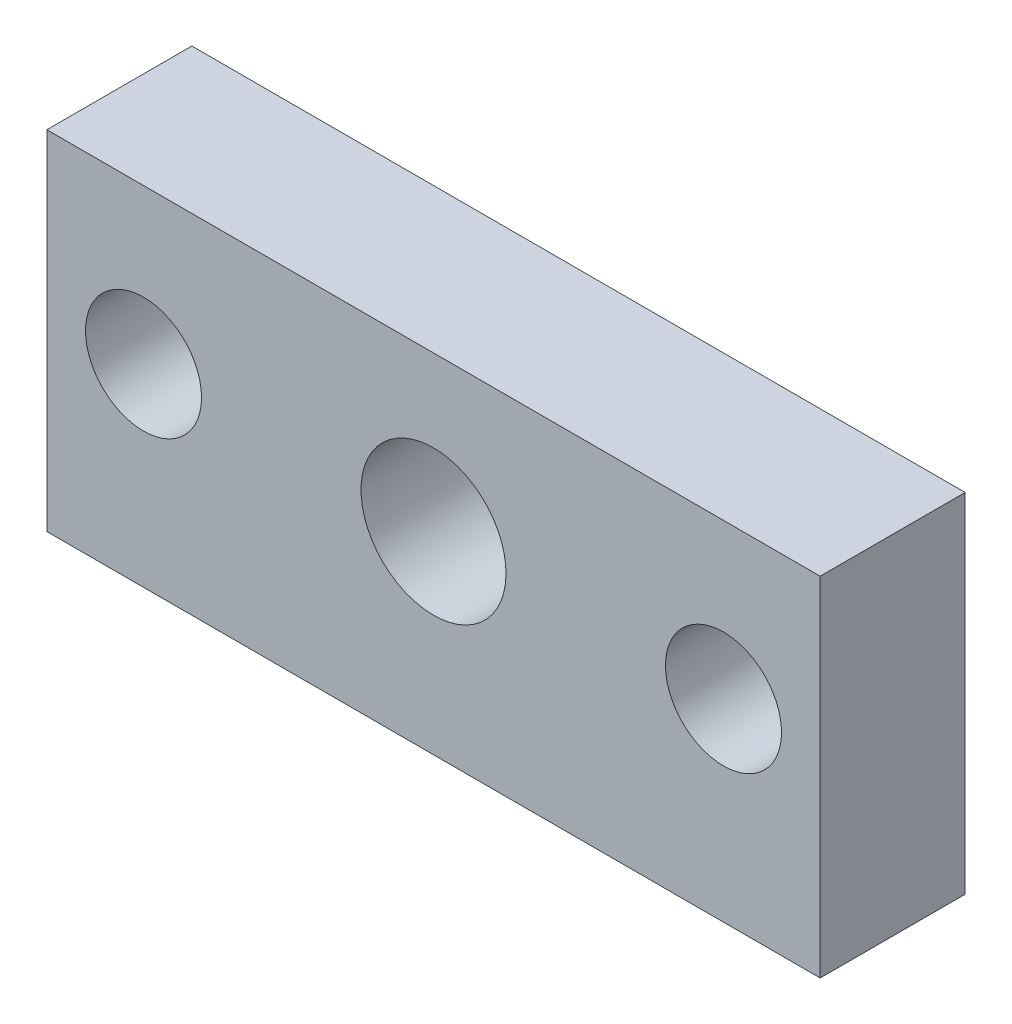
ISO-10303-21;
HEADER;
FILE_DESCRIPTION(('STEP AP214'),'2;1');
FILE_NAME('part.step','',(''),(''),'','','');
FILE_SCHEMA(('AUTOMOTIVE_DESIGN { 1 0 10303 214 1 1 1 1 }'));
ENDSEC;
DATA;
#1=APPLICATION_CONTEXT('core data for automotive mechanical design processes');
#2=APPLICATION_PROTOCOL_DEFINITION('international standard','automotive_design',2000,#1);
#3=PRODUCT_CONTEXT('',#1,'mechanical');
#4=PRODUCT('Part','Part','',(#3));
#5=PRODUCT_RELATED_PRODUCT_CATEGORY('part','',(#4));
#6=PRODUCT_DEFINITION_FORMATION('','',#4);
#7=PRODUCT_DEFINITION_CONTEXT('part definition',#1,'design');
#8=PRODUCT_DEFINITION('design','',#6,#7);
#9=PRODUCT_DEFINITION_SHAPE('','',#8);
#10=(LENGTH_UNIT() NAMED_UNIT(*) SI_UNIT(.MILLI.,.METRE.));
#11=(NAMED_UNIT(*) PLANE_ANGLE_UNIT() SI_UNIT($,.RADIAN.));
#12=(NAMED_UNIT(*) SI_UNIT($,.STERADIAN.) SOLID_ANGLE_UNIT());
#13=UNCERTAINTY_MEASURE_WITH_UNIT(LENGTH_MEASURE(1.E-05),#10,'distance_accuracy_value','');
#14=(GEOMETRIC_REPRESENTATION_CONTEXT(3) GLOBAL_UNCERTAINTY_ASSIGNED_CONTEXT((#13)) GLOBAL_UNIT_ASSIGNED_CONTEXT((#10,
#11,#12)) REPRESENTATION_CONTEXT('',''));
#15=CARTESIAN_POINT('',(0.,0.,0.));
#16=DIRECTION('',(0.,0.,1.));
#17=DIRECTION('',(1.,0.,0.));
#18=AXIS2_PLACEMENT_3D('',#15,#16,#17);
#19=CARTESIAN_POINT('',(0.,0.,15.));
#20=DIRECTION('',(0.,0.,1.));
#21=DIRECTION('',(1.,0.,0.));
#22=AXIS2_PLACEMENT_3D('',#19,#20,#21);
#23=PLANE('',#22);
#24=CARTESIAN_POINT('',(9.33333333333332,4.88888888888889,15.));
#25=DIRECTION('',(0.,0.,1.));
#26=DIRECTION('',(1.,0.,0.));
#27=AXIS2_PLACEMENT_3D('',#24,#25,#26);
#28=CIRCLE('',#27,7.5);
#29=CARTESIAN_POINT('',(16.8333333333333,4.88888888888889,15.));
#30=VERTEX_POINT('',#29);
#31=EDGE_CURVE('E118',#30,#30,#28,.T.);
#32=ORIENTED_EDGE('',*,*,#31,.F.);
#33=EDGE_LOOP('',(#32));
#34=FACE_BOUND('',#33,.T.);
#35=DIRECTION('',(0.,-1.,0.));
#36=VECTOR('',#35,1.);
#37=CARTESIAN_POINT('',(-30.6666666666667,20.8888888888889,15.));
#38=LINE('',#37,#36);
#39=CARTESIAN_POINT('',(-30.6666666666667,20.8888888888889,15.));
#40=VERTEX_POINT('',#39);
#41=CARTESIAN_POINT('',(-30.6666666666667,-15.1111111111111,15.));
#42=VERTEX_POINT('',#41);
#43=EDGE_CURVE('E88',#40,#42,#38,.T.);
#44=ORIENTED_EDGE('',*,*,#43,.T.);
#45=DIRECTION('',(1.,0.,0.));
#46=VECTOR('',#45,1.);
#47=CARTESIAN_POINT('',(-30.6666666666667,-15.1111111111111,15.));
#48=LINE('',#47,#46);
#49=CARTESIAN_POINT('',(49.3333333333333,-15.1111111111111,15.));
#50=VERTEX_POINT('',#49);
#51=EDGE_CURVE('E83',#42,#50,#48,.T.);
#52=ORIENTED_EDGE('',*,*,#51,.T.);
#53=DIRECTION('',(0.,1.,0.));
#54=VECTOR('',#53,1.);
#55=CARTESIAN_POINT('',(49.3333333333333,20.8888888888889,15.));
#56=LINE('',#55,#54);
#57=CARTESIAN_POINT('',(49.3333333333333,20.8888888888889,15.));
#58=VERTEX_POINT('',#57);
#59=EDGE_CURVE('E86',#50,#58,#56,.T.);
#60=ORIENTED_EDGE('',*,*,#59,.T.);
#61=DIRECTION('',(-1.,0.,0.));
#62=VECTOR('',#61,1.);
#63=CARTESIAN_POINT('',(-30.6666666666667,20.8888888888889,15.));
#64=LINE('',#63,#62);
#65=EDGE_CURVE('E53',#58,#40,#64,.T.);
#66=ORIENTED_EDGE('',*,*,#65,.T.);
#67=EDGE_LOOP('',(#44,#52,#60,#66));
#68=FACE_BOUND('',#67,.T.);
#69=CARTESIAN_POINT('',(-20.6666666666667,4.8888888888889,15.));
#70=DIRECTION('',(0.,0.,1.));
#71=DIRECTION('',(1.,0.,0.));
#72=AXIS2_PLACEMENT_3D('',#69,#70,#71);
#73=CIRCLE('',#72,6.);
#74=CARTESIAN_POINT('',(-14.6666666666667,4.8888888888889,15.));
#75=VERTEX_POINT('',#74);
#76=EDGE_CURVE('E103',#75,#75,#73,.T.);
#77=ORIENTED_EDGE('',*,*,#76,.F.);
#78=EDGE_LOOP('',(#77));
#79=FACE_BOUND('',#78,.T.);
#80=CARTESIAN_POINT('',(39.3333333333333,4.88888888888891,15.));
#81=DIRECTION('',(0.,0.,1.));
#82=DIRECTION('',(-1.,0.,0.));
#83=AXIS2_PLACEMENT_3D('',#80,#81,#82);
#84=CIRCLE('',#83,6.);
#85=CARTESIAN_POINT('',(33.3333333333333,4.88888888888891,15.));
#86=VERTEX_POINT('',#85);
#87=EDGE_CURVE('E124',#86,#86,#84,.T.);
#88=ORIENTED_EDGE('',*,*,#87,.F.);
#89=EDGE_LOOP('',(#88));
#90=FACE_BOUND('',#89,.T.);
#91=ADVANCED_FACE('F36',(#34,#68,#79,#90),#23,.T.);
#92=CARTESIAN_POINT('',(0.,0.,0.));
#93=DIRECTION('',(0.,0.,1.));
#94=DIRECTION('',(1.,0.,0.));
#95=AXIS2_PLACEMENT_3D('',#92,#93,#94);
#96=PLANE('',#95);
#97=DIRECTION('',(0.,-1.,0.));
#98=VECTOR('',#97,1.);
#99=CARTESIAN_POINT('',(-30.6666666666667,20.8888888888889,0.));
#100=LINE('',#99,#98);
#101=CARTESIAN_POINT('',(-30.6666666666667,20.8888888888889,0.));
#102=VERTEX_POINT('',#101);
#103=CARTESIAN_POINT('',(-30.6666666666667,-15.1111111111111,0.));
#104=VERTEX_POINT('',#103);
#105=EDGE_CURVE('E100',#102,#104,#100,.T.);
#106=ORIENTED_EDGE('',*,*,#105,.F.);
#107=DIRECTION('',(-1.,0.,0.));
#108=VECTOR('',#107,1.);
#109=CARTESIAN_POINT('',(-30.6666666666667,20.8888888888889,0.));
#110=LINE('',#109,#108);
#111=CARTESIAN_POINT('',(49.3333333333333,20.8888888888889,0.));
#112=VERTEX_POINT('',#111);
#113=EDGE_CURVE('E76',#112,#102,#110,.T.);
#114=ORIENTED_EDGE('',*,*,#113,.F.);
#115=DIRECTION('',(0.,1.,0.));
#116=VECTOR('',#115,1.);
#117=CARTESIAN_POINT('',(49.3333333333333,20.8888888888889,0.));
#118=LINE('',#117,#116);
#119=CARTESIAN_POINT('',(49.3333333333333,-15.1111111111111,0.));
#120=VERTEX_POINT('',#119);
#121=EDGE_CURVE('E70',#120,#112,#118,.T.);
#122=ORIENTED_EDGE('',*,*,#121,.F.);
#123=DIRECTION('',(1.,0.,0.));
#124=VECTOR('',#123,1.);
#125=CARTESIAN_POINT('',(-30.6666666666667,-15.1111111111111,0.));
#126=LINE('',#125,#124);
#127=EDGE_CURVE('E92',#104,#120,#126,.T.);
#128=ORIENTED_EDGE('',*,*,#127,.F.);
#129=EDGE_LOOP('',(#106,#114,#122,#128));
#130=FACE_BOUND('',#129,.T.);
#131=CARTESIAN_POINT('',(-20.6666666666667,4.8888888888889,0.));
#132=DIRECTION('',(0.,0.,1.));
#133=DIRECTION('',(1.,0.,0.));
#134=AXIS2_PLACEMENT_3D('',#131,#132,#133);
#135=CIRCLE('',#134,6.);
#136=CARTESIAN_POINT('',(-14.6666666666667,4.8888888888889,0.));
#137=VERTEX_POINT('',#136);
#138=EDGE_CURVE('E115',#137,#137,#135,.T.);
#139=ORIENTED_EDGE('',*,*,#138,.T.);
#140=EDGE_LOOP('',(#139));
#141=FACE_BOUND('',#140,.T.);
#142=CARTESIAN_POINT('',(9.33333333333332,4.88888888888889,0.));
#143=DIRECTION('',(0.,0.,1.));
#144=DIRECTION('',(1.,0.,0.));
#145=AXIS2_PLACEMENT_3D('',#142,#143,#144);
#146=CIRCLE('',#145,7.5);
#147=CARTESIAN_POINT('',(16.8333333333333,4.88888888888889,0.));
#148=VERTEX_POINT('',#147);
#149=EDGE_CURVE('E121',#148,#148,#146,.T.);
#150=ORIENTED_EDGE('',*,*,#149,.T.);
#151=EDGE_LOOP('',(#150));
#152=FACE_BOUND('',#151,.T.);
#153=CARTESIAN_POINT('',(39.3333333333333,4.88888888888891,0.));
#154=DIRECTION('',(0.,0.,1.));
#155=DIRECTION('',(-1.,0.,0.));
#156=AXIS2_PLACEMENT_3D('',#153,#154,#155);
#157=CIRCLE('',#156,6.);
#158=CARTESIAN_POINT('',(33.3333333333333,4.88888888888891,0.));
#159=VERTEX_POINT('',#158);
#160=EDGE_CURVE('E127',#159,#159,#157,.T.);
#161=ORIENTED_EDGE('',*,*,#160,.T.);
#162=EDGE_LOOP('',(#161));
#163=FACE_BOUND('',#162,.T.);
#164=ADVANCED_FACE('F111',(#130,#141,#152,#163),#96,.F.);
#165=CARTESIAN_POINT('',(-30.6666666666667,20.8888888888889,15.));
#166=DIRECTION('',(1.,0.,0.));
#167=DIRECTION('',(0.,1.,0.));
#168=AXIS2_PLACEMENT_3D('',#165,#166,#167);
#169=PLANE('',#168);
#170=ORIENTED_EDGE('',*,*,#105,.T.);
#171=DIRECTION('',(0.,0.,-1.));
#172=VECTOR('',#171,1.);
#173=CARTESIAN_POINT('',(-30.6666666666667,-15.1111111111111,15.));
#174=LINE('',#173,#172);
#175=EDGE_CURVE('E11',#42,#104,#174,.T.);
#176=ORIENTED_EDGE('',*,*,#175,.F.);
#177=ORIENTED_EDGE('',*,*,#43,.F.);
#178=DIRECTION('',(0.,0.,-1.));
#179=VECTOR('',#178,1.);
#180=CARTESIAN_POINT('',(-30.6666666666667,20.8888888888889,15.));
#181=LINE('',#180,#179);
#182=EDGE_CURVE('E96',#40,#102,#181,.T.);
#183=ORIENTED_EDGE('',*,*,#182,.T.);
#184=EDGE_LOOP('',(#170,#176,#177,#183));
#185=FACE_BOUND('',#184,.T.);
#186=ADVANCED_FACE('F38',(#185),#169,.F.);
#187=CARTESIAN_POINT('',(-30.6666666666667,-15.1111111111111,15.));
#188=DIRECTION('',(0.,1.,0.));
#189=DIRECTION('',(0.,0.,1.));
#190=AXIS2_PLACEMENT_3D('',#187,#188,#189);
#191=PLANE('',#190);
#192=ORIENTED_EDGE('',*,*,#127,.T.);
#193=DIRECTION('',(0.,0.,-1.));
#194=VECTOR('',#193,1.);
#195=CARTESIAN_POINT('',(49.3333333333333,-15.1111111111111,15.));
#196=LINE('',#195,#194);
#197=EDGE_CURVE('E45',#50,#120,#196,.T.);
#198=ORIENTED_EDGE('',*,*,#197,.F.);
#199=ORIENTED_EDGE('',*,*,#51,.F.);
#200=ORIENTED_EDGE('',*,*,#175,.T.);
#201=EDGE_LOOP('',(#192,#198,#199,#200));
#202=FACE_BOUND('',#201,.T.);
#203=ADVANCED_FACE('F91',(#202),#191,.F.);
#204=CARTESIAN_POINT('',(49.3333333333333,20.8888888888889,15.));
#205=DIRECTION('',(-1.,0.,0.));
#206=DIRECTION('',(0.,0.,1.));
#207=AXIS2_PLACEMENT_3D('',#204,#205,#206);
#208=PLANE('',#207);
#209=ORIENTED_EDGE('',*,*,#121,.T.);
#210=DIRECTION('',(0.,0.,-1.));
#211=VECTOR('',#210,1.);
#212=CARTESIAN_POINT('',(49.3333333333333,20.8888888888889,15.));
#213=LINE('',#212,#211);
#214=EDGE_CURVE('E93',#58,#112,#213,.T.);
#215=ORIENTED_EDGE('',*,*,#214,.F.);
#216=ORIENTED_EDGE('',*,*,#59,.F.);
#217=ORIENTED_EDGE('',*,*,#197,.T.);
#218=EDGE_LOOP('',(#209,#215,#216,#217));
#219=FACE_BOUND('',#218,.T.);
#220=ADVANCED_FACE('F94',(#219),#208,.F.);
#221=CARTESIAN_POINT('',(-30.6666666666667,20.8888888888889,15.));
#222=DIRECTION('',(0.,-1.,0.));
#223=DIRECTION('',(0.,0.,-1.));
#224=AXIS2_PLACEMENT_3D('',#221,#222,#223);
#225=PLANE('',#224);
#226=ORIENTED_EDGE('',*,*,#113,.T.);
#227=ORIENTED_EDGE('',*,*,#182,.F.);
#228=ORIENTED_EDGE('',*,*,#65,.F.);
#229=ORIENTED_EDGE('',*,*,#214,.T.);
#230=EDGE_LOOP('',(#226,#227,#228,#229));
#231=FACE_BOUND('',#230,.T.);
#232=ADVANCED_FACE('F108',(#231),#225,.F.);
#233=CARTESIAN_POINT('',(-20.6666666666667,4.8888888888889,15.));
#234=DIRECTION('',(0.,0.,-1.));
#235=DIRECTION('',(-1.,0.,0.));
#236=AXIS2_PLACEMENT_3D('',#233,#234,#235);
#237=CYLINDRICAL_SURFACE('',#236,6.);
#238=ORIENTED_EDGE('',*,*,#76,.T.);
#239=EDGE_LOOP('',(#238));
#240=FACE_BOUND('',#239,.T.);
#241=ORIENTED_EDGE('',*,*,#138,.F.);
#242=EDGE_LOOP('',(#241));
#243=FACE_BOUND('',#242,.T.);
#244=ADVANCED_FACE('F145',(#240,#243),#237,.F.);
#245=CARTESIAN_POINT('',(9.33333333333332,4.88888888888889,15.));
#246=DIRECTION('',(0.,0.,-1.));
#247=DIRECTION('',(-1.,0.,0.));
#248=AXIS2_PLACEMENT_3D('',#245,#246,#247);
#249=CYLINDRICAL_SURFACE('',#248,7.5);
#250=ORIENTED_EDGE('',*,*,#31,.T.);
#251=EDGE_LOOP('',(#250));
#252=FACE_BOUND('',#251,.T.);
#253=ORIENTED_EDGE('',*,*,#149,.F.);
#254=EDGE_LOOP('',(#253));
#255=FACE_BOUND('',#254,.T.);
#256=ADVANCED_FACE('F193',(#252,#255),#249,.F.);
#257=CARTESIAN_POINT('',(39.3333333333333,4.88888888888891,15.));
#258=DIRECTION('',(0.,0.,-1.));
#259=DIRECTION('',(-1.,0.,0.));
#260=AXIS2_PLACEMENT_3D('',#257,#258,#259);
#261=CYLINDRICAL_SURFACE('',#260,6.);
#262=ORIENTED_EDGE('',*,*,#87,.T.);
#263=EDGE_LOOP('',(#262));
#264=FACE_BOUND('',#263,.T.);
#265=ORIENTED_EDGE('',*,*,#160,.F.);
#266=EDGE_LOOP('',(#265));
#267=FACE_BOUND('',#266,.T.);
#268=ADVANCED_FACE('F133',(#264,#267),#261,.F.);
#269=CLOSED_SHELL('',(#91,#164,#186,#203,#220,#232,#244,#256,#268));
#270=MANIFOLD_SOLID_BREP('B2',#269);
#271=ADVANCED_BREP_SHAPE_REPRESENTATION('',(#18,#270),#14);
#272=SHAPE_DEFINITION_REPRESENTATION(#9,#271);
ENDSEC;
END-ISO-10303-21;
